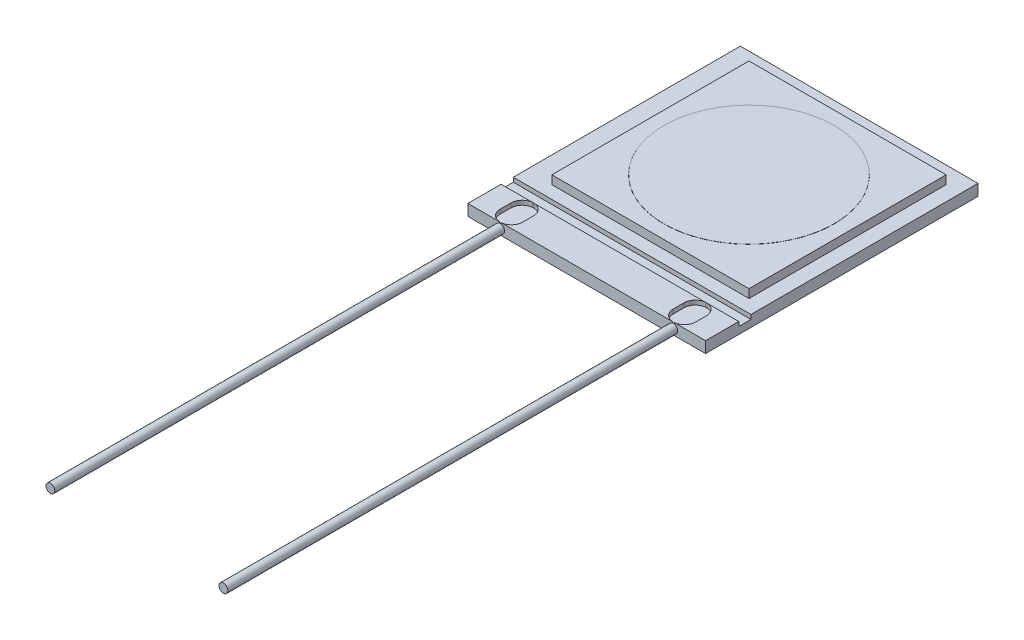
ISO-10303-21;
HEADER;
FILE_DESCRIPTION(('STEP AP214'),'2;1');
FILE_NAME('part.step','',(''),(''),'','','');
FILE_SCHEMA(('AUTOMOTIVE_DESIGN { 1 0 10303 214 1 1 1 1 }'));
ENDSEC;
DATA;
#1=APPLICATION_CONTEXT('core data for automotive mechanical design processes');
#2=APPLICATION_PROTOCOL_DEFINITION('international standard','automotive_design',2000,#1);
#3=PRODUCT_CONTEXT('',#1,'mechanical');
#4=PRODUCT('Part','Part','',(#3));
#5=PRODUCT_RELATED_PRODUCT_CATEGORY('part','',(#4));
#6=PRODUCT_DEFINITION_FORMATION('','',#4);
#7=PRODUCT_DEFINITION_CONTEXT('part definition',#1,'design');
#8=PRODUCT_DEFINITION('design','',#6,#7);
#9=PRODUCT_DEFINITION_SHAPE('','',#8);
#10=(LENGTH_UNIT() NAMED_UNIT(*) SI_UNIT(.MILLI.,.METRE.));
#11=(NAMED_UNIT(*) PLANE_ANGLE_UNIT() SI_UNIT($,.RADIAN.));
#12=(NAMED_UNIT(*) SI_UNIT($,.STERADIAN.) SOLID_ANGLE_UNIT());
#13=UNCERTAINTY_MEASURE_WITH_UNIT(LENGTH_MEASURE(1.E-05),#10,'distance_accuracy_value','');
#14=(GEOMETRIC_REPRESENTATION_CONTEXT(3) GLOBAL_UNCERTAINTY_ASSIGNED_CONTEXT((#13)) GLOBAL_UNIT_ASSIGNED_CONTEXT((#10,
#11,#12)) REPRESENTATION_CONTEXT('',''));
#15=CARTESIAN_POINT('',(0.,0.,0.));
#16=DIRECTION('',(0.,0.,1.));
#17=DIRECTION('',(1.,0.,0.));
#18=AXIS2_PLACEMENT_3D('',#15,#16,#17);
#19=CARTESIAN_POINT('',(3.49,0.3302,4.));
#20=DIRECTION('',(0.,0.,-1.));
#21=DIRECTION('',(-1.,0.,0.));
#22=AXIS2_PLACEMENT_3D('',#19,#20,#21);
#23=PLANE('',#22);
#24=CARTESIAN_POINT('',(2.54,0.165099999999987,4.));
#25=DIRECTION('',(0.,0.,1.));
#26=DIRECTION('',(-1.,0.,0.));
#27=AXIS2_PLACEMENT_3D('',#24,#25,#26);
#28=CIRCLE('',#27,0.129854710524441);
#29=CARTESIAN_POINT('',(2.51975239636127,0.293366442970372,4.));
#30=VERTEX_POINT('',#29);
#31=CARTESIAN_POINT('',(2.56024760363874,0.293366442970372,4.));
#32=VERTEX_POINT('',#31);
#33=EDGE_CURVE('E254',#30,#32,#28,.T.);
#34=ORIENTED_EDGE('',*,*,#33,.F.);
#35=DIRECTION('',(0.,1.,0.));
#36=VECTOR('',#35,1.);
#37=CARTESIAN_POINT('',(2.51975239636126,0.2032,4.));
#38=LINE('',#37,#36);
#39=CARTESIAN_POINT('',(2.51975239636126,0.3302,4.));
#40=VERTEX_POINT('',#39);
#41=EDGE_CURVE('E249',#30,#40,#38,.T.);
#42=ORIENTED_EDGE('',*,*,#41,.T.);
#43=DIRECTION('',(1.,0.,0.));
#44=VECTOR('',#43,1.);
#45=CARTESIAN_POINT('',(3.49,0.3302,4.));
#46=LINE('',#45,#44);
#47=CARTESIAN_POINT('',(-2.51975239636127,0.3302,4.));
#48=VERTEX_POINT('',#47);
#49=EDGE_CURVE('E267',#48,#40,#46,.T.);
#50=ORIENTED_EDGE('',*,*,#49,.F.);
#51=DIRECTION('',(0.,1.,0.));
#52=VECTOR('',#51,1.);
#53=CARTESIAN_POINT('',(-2.51975239636127,0.2032,4.));
#54=LINE('',#53,#52);
#55=CARTESIAN_POINT('',(-2.51975239636127,0.293366442970386,4.));
#56=VERTEX_POINT('',#55);
#57=EDGE_CURVE('E619',#56,#48,#54,.T.);
#58=ORIENTED_EDGE('',*,*,#57,.F.);
#59=CARTESIAN_POINT('',(-2.54,0.1651,4.));
#60=DIRECTION('',(0.,0.,1.));
#61=DIRECTION('',(1.,0.,0.));
#62=AXIS2_PLACEMENT_3D('',#59,#60,#61);
#63=CIRCLE('',#62,0.129854710524441);
#64=CARTESIAN_POINT('',(-2.56024760363873,0.293366442970386,4.));
#65=VERTEX_POINT('',#64);
#66=EDGE_CURVE('E12',#65,#56,#63,.T.);
#67=ORIENTED_EDGE('',*,*,#66,.F.);
#68=DIRECTION('',(0.,1.,0.));
#69=VECTOR('',#68,1.);
#70=CARTESIAN_POINT('',(-2.56024760363873,0.2032,4.));
#71=LINE('',#70,#69);
#72=CARTESIAN_POINT('',(-2.56024760363873,0.3302,4.));
#73=VERTEX_POINT('',#72);
#74=EDGE_CURVE('E248',#65,#73,#71,.T.);
#75=ORIENTED_EDGE('',*,*,#74,.T.);
#76=CARTESIAN_POINT('',(-3.49,0.3302,4.));
#77=VERTEX_POINT('',#76);
#78=EDGE_CURVE('E401',#77,#73,#46,.T.);
#79=ORIENTED_EDGE('',*,*,#78,.F.);
#80=DIRECTION('',(0.,-1.,0.));
#81=VECTOR('',#80,1.);
#82=CARTESIAN_POINT('',(-3.49,0.3302,4.));
#83=LINE('',#82,#81);
#84=CARTESIAN_POINT('',(-3.49,0.,4.));
#85=VERTEX_POINT('',#84);
#86=EDGE_CURVE('E419',#77,#85,#83,.T.);
#87=ORIENTED_EDGE('',*,*,#86,.T.);
#88=DIRECTION('',(1.,0.,0.));
#89=VECTOR('',#88,1.);
#90=CARTESIAN_POINT('',(3.49,0.,4.));
#91=LINE('',#90,#89);
#92=CARTESIAN_POINT('',(3.49,0.,4.));
#93=VERTEX_POINT('',#92);
#94=EDGE_CURVE('E416',#85,#93,#91,.T.);
#95=ORIENTED_EDGE('',*,*,#94,.T.);
#96=DIRECTION('',(0.,-1.,0.));
#97=VECTOR('',#96,1.);
#98=CARTESIAN_POINT('',(3.49,0.3302,4.));
#99=LINE('',#98,#97);
#100=CARTESIAN_POINT('',(3.49,0.3302,4.));
#101=VERTEX_POINT('',#100);
#102=EDGE_CURVE('E357',#101,#93,#99,.T.);
#103=ORIENTED_EDGE('',*,*,#102,.F.);
#104=CARTESIAN_POINT('',(2.56024760363874,0.3302,4.));
#105=VERTEX_POINT('',#104);
#106=EDGE_CURVE('E405',#105,#101,#46,.T.);
#107=ORIENTED_EDGE('',*,*,#106,.F.);
#108=DIRECTION('',(0.,1.,0.));
#109=VECTOR('',#108,1.);
#110=CARTESIAN_POINT('',(2.56024760363874,0.2032,4.));
#111=LINE('',#110,#109);
#112=EDGE_CURVE('E261',#32,#105,#111,.T.);
#113=ORIENTED_EDGE('',*,*,#112,.F.);
#114=EDGE_LOOP('',(#34,#42,#50,#58,#67,#75,#79,#87,#95,#103,#107,#113));
#115=FACE_BOUND('',#114,.T.);
#116=ADVANCED_FACE('F45',(#115),#23,.F.);
#117=CARTESIAN_POINT('',(3.055,0.5802,-3.5));
#118=DIRECTION('',(0.,-1.,0.));
#119=DIRECTION('',(0.,0.,-1.));
#120=AXIS2_PLACEMENT_3D('',#117,#118,#119);
#121=PLANE('',#120);
#122=DIRECTION('',(0.,0.,-1.));
#123=VECTOR('',#122,1.);
#124=CARTESIAN_POINT('',(3.055,0.5802,2.29));
#125=LINE('',#124,#123);
#126=CARTESIAN_POINT('',(3.055,0.5802,2.29));
#127=VERTEX_POINT('',#126);
#128=CARTESIAN_POINT('',(3.055,0.5802,-3.5));
#129=VERTEX_POINT('',#128);
#130=EDGE_CURVE('E332',#127,#129,#125,.T.);
#131=ORIENTED_EDGE('',*,*,#130,.T.);
#132=DIRECTION('',(-1.,0.,0.));
#133=VECTOR('',#132,1.);
#134=CARTESIAN_POINT('',(-2.735,0.5802,-3.5));
#135=LINE('',#134,#133);
#136=CARTESIAN_POINT('',(-2.735,0.5802,-3.5));
#137=VERTEX_POINT('',#136);
#138=EDGE_CURVE('E374',#129,#137,#135,.T.);
#139=ORIENTED_EDGE('',*,*,#138,.T.);
#140=DIRECTION('',(0.,0.,1.));
#141=VECTOR('',#140,1.);
#142=CARTESIAN_POINT('',(-2.735,0.5802,2.29));
#143=LINE('',#142,#141);
#144=CARTESIAN_POINT('',(-2.735,0.5802,2.29));
#145=VERTEX_POINT('',#144);
#146=EDGE_CURVE('E368',#137,#145,#143,.T.);
#147=ORIENTED_EDGE('',*,*,#146,.T.);
#148=DIRECTION('',(1.,0.,0.));
#149=VECTOR('',#148,1.);
#150=CARTESIAN_POINT('',(-2.735,0.5802,2.29));
#151=LINE('',#150,#149);
#152=EDGE_CURVE('E365',#145,#127,#151,.T.);
#153=ORIENTED_EDGE('',*,*,#152,.T.);
#154=EDGE_LOOP('',(#131,#139,#147,#153));
#155=FACE_BOUND('',#154,.T.);
#156=CARTESIAN_POINT('',(0.160000000000001,0.5802,-0.604999999999997));
#157=DIRECTION('',(0.,-1.,0.));
#158=DIRECTION('',(0.,0.,-1.));
#159=AXIS2_PLACEMENT_3D('',#156,#157,#158);
#160=CIRCLE('',#159,2.499995);
#161=CARTESIAN_POINT('',(0.160000000000001,0.5802,-3.104995));
#162=VERTEX_POINT('',#161);
#163=EDGE_CURVE('E49',#162,#162,#160,.F.);
#164=ORIENTED_EDGE('',*,*,#163,.F.);
#165=EDGE_LOOP('',(#164));
#166=FACE_BOUND('',#165,.T.);
#167=ADVANCED_FACE('F509',(#155,#166),#121,.F.);
#168=CARTESIAN_POINT('',(-3.49,0.3302,-4.));
#169=DIRECTION('',(0.,1.,0.));
#170=DIRECTION('',(0.,0.,1.));
#171=AXIS2_PLACEMENT_3D('',#168,#169,#170);
#172=PLANE('',#171);
#173=DIRECTION('',(1.,0.,0.));
#174=VECTOR('',#173,1.);
#175=CARTESIAN_POINT('',(0.,0.3302,3.02464));
#176=LINE('',#175,#174);
#177=CARTESIAN_POINT('',(2.56511819770642,0.3302,3.02464));
#178=VERTEX_POINT('',#177);
#179=CARTESIAN_POINT('',(3.49,0.3302,3.02464));
#180=VERTEX_POINT('',#179);
#181=EDGE_CURVE('E295',#178,#180,#176,.T.);
#182=ORIENTED_EDGE('',*,*,#181,.F.);
#183=CARTESIAN_POINT('',(2.54,0.3302,3.35388324768168));
#184=DIRECTION('',(0.,1.,0.));
#185=DIRECTION('',(0.,0.,1.));
#186=AXIS2_PLACEMENT_3D('',#183,#184,#185);
#187=CIRCLE('',#186,0.3302);
#188=CARTESIAN_POINT('',(2.8702,0.3302,3.35388324768168));
#189=VERTEX_POINT('',#188);
#190=EDGE_CURVE('E467',#178,#189,#187,.F.);
#191=ORIENTED_EDGE('',*,*,#190,.T.);
#192=DIRECTION('',(0.,0.,-1.));
#193=VECTOR('',#192,1.);
#194=CARTESIAN_POINT('',(2.8702,0.3302,0.));
#195=LINE('',#194,#193);
#196=CARTESIAN_POINT('',(2.8702,0.3302,3.67042136818828));
#197=VERTEX_POINT('',#196);
#198=EDGE_CURVE('E477',#197,#189,#195,.T.);
#199=ORIENTED_EDGE('',*,*,#198,.F.);
#200=CARTESIAN_POINT('',(2.54,0.3302,3.67042136818828));
#201=DIRECTION('',(0.,1.,0.));
#202=DIRECTION('',(0.,0.,1.));
#203=AXIS2_PLACEMENT_3D('',#200,#201,#202);
#204=CIRCLE('',#203,0.3302);
#205=EDGE_CURVE('E269',#197,#105,#204,.F.);
#206=ORIENTED_EDGE('',*,*,#205,.T.);
#207=ORIENTED_EDGE('',*,*,#106,.T.);
#208=DIRECTION('',(0.,0.,-1.));
#209=VECTOR('',#208,1.);
#210=CARTESIAN_POINT('',(3.49,0.3302,4.));
#211=LINE('',#210,#209);
#212=EDGE_CURVE('E406',#101,#180,#211,.T.);
#213=ORIENTED_EDGE('',*,*,#212,.T.);
#214=EDGE_LOOP('',(#182,#191,#199,#206,#207,#213));
#215=FACE_BOUND('',#214,.T.);
#216=ADVANCED_FACE('F514',(#215),#172,.T.);
#217=DIRECTION('',(0.,0.,-1.));
#218=VECTOR('',#217,1.);
#219=CARTESIAN_POINT('',(2.2098,0.3302,0.));
#220=LINE('',#219,#218);
#221=CARTESIAN_POINT('',(2.2098,0.3302,3.67042136818828));
#222=VERTEX_POINT('',#221);
#223=CARTESIAN_POINT('',(2.2098,0.3302,3.35388324768168));
#224=VERTEX_POINT('',#223);
#225=EDGE_CURVE('E409',#222,#224,#220,.T.);
#226=ORIENTED_EDGE('',*,*,#225,.T.);
#227=CARTESIAN_POINT('',(2.51488180229358,0.3302,3.02464));
#228=VERTEX_POINT('',#227);
#229=EDGE_CURVE('E464',#224,#228,#187,.F.);
#230=ORIENTED_EDGE('',*,*,#229,.T.);
#231=CARTESIAN_POINT('',(-2.51488180229356,0.3302,3.02464));
#232=VERTEX_POINT('',#231);
#233=EDGE_CURVE('E306',#232,#228,#176,.T.);
#234=ORIENTED_EDGE('',*,*,#233,.F.);
#235=CARTESIAN_POINT('',(-2.54,0.3302,3.35388324768168));
#236=DIRECTION('',(0.,1.,0.));
#237=DIRECTION('',(0.,0.,1.));
#238=AXIS2_PLACEMENT_3D('',#235,#236,#237);
#239=CIRCLE('',#238,0.3302);
#240=CARTESIAN_POINT('',(-2.2098,0.3302,3.35388324768168));
#241=VERTEX_POINT('',#240);
#242=EDGE_CURVE('E304',#241,#232,#239,.T.);
#243=ORIENTED_EDGE('',*,*,#242,.F.);
#244=DIRECTION('',(0.,0.,-1.));
#245=VECTOR('',#244,1.);
#246=CARTESIAN_POINT('',(-2.2098,0.3302,0.));
#247=LINE('',#246,#245);
#248=CARTESIAN_POINT('',(-2.2098,0.3302,3.67042136818828));
#249=VERTEX_POINT('',#248);
#250=EDGE_CURVE('E433',#249,#241,#247,.T.);
#251=ORIENTED_EDGE('',*,*,#250,.F.);
#252=CARTESIAN_POINT('',(-2.54,0.3302,3.67042136818828));
#253=DIRECTION('',(0.,1.,0.));
#254=DIRECTION('',(0.,0.,1.));
#255=AXIS2_PLACEMENT_3D('',#252,#253,#254);
#256=CIRCLE('',#255,0.3302);
#257=EDGE_CURVE('E620',#48,#249,#256,.T.);
#258=ORIENTED_EDGE('',*,*,#257,.F.);
#259=ORIENTED_EDGE('',*,*,#49,.T.);
#260=EDGE_CURVE('E265',#40,#222,#204,.F.);
#261=ORIENTED_EDGE('',*,*,#260,.T.);
#262=EDGE_LOOP('',(#226,#230,#234,#243,#251,#258,#259,#261));
#263=FACE_BOUND('',#262,.T.);
#264=ADVANCED_FACE('F543',(#263),#172,.T.);
#265=CARTESIAN_POINT('',(-2.8702,0.3302,3.67042136818828));
#266=VERTEX_POINT('',#265);
#267=EDGE_CURVE('E614',#266,#73,#256,.T.);
#268=ORIENTED_EDGE('',*,*,#267,.F.);
#269=DIRECTION('',(0.,0.,-1.));
#270=VECTOR('',#269,1.);
#271=CARTESIAN_POINT('',(-2.8702,0.3302,0.));
#272=LINE('',#271,#270);
#273=CARTESIAN_POINT('',(-2.8702,0.3302,3.35388324768168));
#274=VERTEX_POINT('',#273);
#275=EDGE_CURVE('E418',#266,#274,#272,.T.);
#276=ORIENTED_EDGE('',*,*,#275,.T.);
#277=CARTESIAN_POINT('',(-2.56511819770644,0.3302,3.02464));
#278=VERTEX_POINT('',#277);
#279=EDGE_CURVE('E305',#278,#274,#239,.T.);
#280=ORIENTED_EDGE('',*,*,#279,.F.);
#281=CARTESIAN_POINT('',(-3.49,0.3302,3.02464));
#282=VERTEX_POINT('',#281);
#283=EDGE_CURVE('E309',#282,#278,#176,.T.);
#284=ORIENTED_EDGE('',*,*,#283,.F.);
#285=DIRECTION('',(0.,0.,1.));
#286=VECTOR('',#285,1.);
#287=CARTESIAN_POINT('',(-3.49,0.3302,4.));
#288=LINE('',#287,#286);
#289=EDGE_CURVE('E402',#282,#77,#288,.T.);
#290=ORIENTED_EDGE('',*,*,#289,.T.);
#291=ORIENTED_EDGE('',*,*,#78,.T.);
#292=EDGE_LOOP('',(#268,#276,#280,#284,#290,#291));
#293=FACE_BOUND('',#292,.T.);
#294=ADVANCED_FACE('F608',(#293),#172,.T.);
#295=DIRECTION('',(-1.,0.,0.));
#296=VECTOR('',#295,1.);
#297=CARTESIAN_POINT('',(-2.735,0.3302,-3.5));
#298=LINE('',#297,#296);
#299=CARTESIAN_POINT('',(3.055,0.3302,-3.5));
#300=VERTEX_POINT('',#299);
#301=CARTESIAN_POINT('',(-2.735,0.3302,-3.5));
#302=VERTEX_POINT('',#301);
#303=EDGE_CURVE('E382',#300,#302,#298,.T.);
#304=ORIENTED_EDGE('',*,*,#303,.F.);
#305=DIRECTION('',(0.,0.,-1.));
#306=VECTOR('',#305,1.);
#307=CARTESIAN_POINT('',(3.055,0.3302,2.29));
#308=LINE('',#307,#306);
#309=CARTESIAN_POINT('',(3.055,0.3302,2.29));
#310=VERTEX_POINT('',#309);
#311=EDGE_CURVE('E377',#310,#300,#308,.T.);
#312=ORIENTED_EDGE('',*,*,#311,.F.);
#313=DIRECTION('',(1.,0.,0.));
#314=VECTOR('',#313,1.);
#315=CARTESIAN_POINT('',(-2.735,0.3302,2.29));
#316=LINE('',#315,#314);
#317=CARTESIAN_POINT('',(-2.735,0.3302,2.29));
#318=VERTEX_POINT('',#317);
#319=EDGE_CURVE('E389',#318,#310,#316,.T.);
#320=ORIENTED_EDGE('',*,*,#319,.F.);
#321=DIRECTION('',(0.,0.,1.));
#322=VECTOR('',#321,1.);
#323=CARTESIAN_POINT('',(-2.735,0.3302,2.29));
#324=LINE('',#323,#322);
#325=EDGE_CURVE('E385',#302,#318,#324,.T.);
#326=ORIENTED_EDGE('',*,*,#325,.F.);
#327=EDGE_LOOP('',(#304,#312,#320,#326));
#328=FACE_BOUND('',#327,.T.);
#329=CARTESIAN_POINT('',(-3.49,0.3302,-4.));
#330=VERTEX_POINT('',#329);
#331=CARTESIAN_POINT('',(-3.49,0.3302,2.6665));
#332=VERTEX_POINT('',#331);
#333=EDGE_CURVE('E398',#330,#332,#288,.T.);
#334=ORIENTED_EDGE('',*,*,#333,.T.);
#335=DIRECTION('',(1.,0.,0.));
#336=VECTOR('',#335,1.);
#337=CARTESIAN_POINT('',(0.,0.3302,2.6665));
#338=LINE('',#337,#336);
#339=CARTESIAN_POINT('',(3.49,0.3302,2.6665));
#340=VERTEX_POINT('',#339);
#341=EDGE_CURVE('E321',#332,#340,#338,.T.);
#342=ORIENTED_EDGE('',*,*,#341,.T.);
#343=CARTESIAN_POINT('',(3.49,0.3302,-4.));
#344=VERTEX_POINT('',#343);
#345=EDGE_CURVE('E410',#340,#344,#211,.T.);
#346=ORIENTED_EDGE('',*,*,#345,.T.);
#347=DIRECTION('',(-1.,0.,0.));
#348=VECTOR('',#347,1.);
#349=CARTESIAN_POINT('',(3.49,0.3302,-4.));
#350=LINE('',#349,#348);
#351=EDGE_CURVE('E358',#344,#330,#350,.T.);
#352=ORIENTED_EDGE('',*,*,#351,.T.);
#353=EDGE_LOOP('',(#334,#342,#346,#352));
#354=FACE_BOUND('',#353,.T.);
#355=ADVANCED_FACE('F592',(#328,#354),#172,.T.);
#356=CARTESIAN_POINT('',(3.49,0.3302,4.));
#357=DIRECTION('',(-1.,0.,0.));
#358=DIRECTION('',(0.,0.,1.));
#359=AXIS2_PLACEMENT_3D('',#356,#357,#358);
#360=PLANE('',#359);
#361=DIRECTION('',(0.,1.,0.));
#362=VECTOR('',#361,1.);
#363=CARTESIAN_POINT('',(3.49,0.2032,2.6665));
#364=LINE('',#363,#362);
#365=CARTESIAN_POINT('',(3.49,0.2032,2.6665));
#366=VERTEX_POINT('',#365);
#367=EDGE_CURVE('E327',#366,#340,#364,.T.);
#368=ORIENTED_EDGE('',*,*,#367,.F.);
#369=DIRECTION('',(0.,0.,-1.));
#370=VECTOR('',#369,1.);
#371=CARTESIAN_POINT('',(3.49,0.2032,0.));
#372=LINE('',#371,#370);
#373=CARTESIAN_POINT('',(3.49,0.2032,3.02464));
#374=VERTEX_POINT('',#373);
#375=EDGE_CURVE('E331',#374,#366,#372,.T.);
#376=ORIENTED_EDGE('',*,*,#375,.F.);
#377=DIRECTION('',(0.,1.,0.));
#378=VECTOR('',#377,1.);
#379=CARTESIAN_POINT('',(3.49,0.2032,3.02464));
#380=LINE('',#379,#378);
#381=EDGE_CURVE('E355',#374,#180,#380,.T.);
#382=ORIENTED_EDGE('',*,*,#381,.T.);
#383=ORIENTED_EDGE('',*,*,#212,.F.);
#384=ORIENTED_EDGE('',*,*,#102,.T.);
#385=DIRECTION('',(0.,0.,-1.));
#386=VECTOR('',#385,1.);
#387=CARTESIAN_POINT('',(3.49,0.,4.));
#388=LINE('',#387,#386);
#389=CARTESIAN_POINT('',(3.49,0.,-4.));
#390=VERTEX_POINT('',#389);
#391=EDGE_CURVE('E353',#93,#390,#388,.T.);
#392=ORIENTED_EDGE('',*,*,#391,.T.);
#393=DIRECTION('',(0.,-1.,0.));
#394=VECTOR('',#393,1.);
#395=CARTESIAN_POINT('',(3.49,0.3302,-4.));
#396=LINE('',#395,#394);
#397=EDGE_CURVE('E381',#344,#390,#396,.T.);
#398=ORIENTED_EDGE('',*,*,#397,.F.);
#399=ORIENTED_EDGE('',*,*,#345,.F.);
#400=EDGE_LOOP('',(#368,#376,#382,#383,#384,#392,#398,#399));
#401=FACE_BOUND('',#400,.T.);
#402=ADVANCED_FACE('F518',(#401),#360,.F.);
#403=CARTESIAN_POINT('',(-3.49,0.3302,4.));
#404=DIRECTION('',(1.,0.,0.));
#405=DIRECTION('',(0.,0.,-1.));
#406=AXIS2_PLACEMENT_3D('',#403,#404,#405);
#407=PLANE('',#406);
#408=ORIENTED_EDGE('',*,*,#289,.F.);
#409=DIRECTION('',(0.,1.,0.));
#410=VECTOR('',#409,1.);
#411=CARTESIAN_POINT('',(-3.49,0.2032,3.02464));
#412=LINE('',#411,#410);
#413=CARTESIAN_POINT('',(-3.49,0.2032,3.02464));
#414=VERTEX_POINT('',#413);
#415=EDGE_CURVE('E312',#414,#282,#412,.T.);
#416=ORIENTED_EDGE('',*,*,#415,.F.);
#417=DIRECTION('',(0.,0.,1.));
#418=VECTOR('',#417,1.);
#419=CARTESIAN_POINT('',(-3.49,0.2032,0.));
#420=LINE('',#419,#418);
#421=CARTESIAN_POINT('',(-3.49,0.2032,2.6665));
#422=VERTEX_POINT('',#421);
#423=EDGE_CURVE('E319',#422,#414,#420,.T.);
#424=ORIENTED_EDGE('',*,*,#423,.F.);
#425=DIRECTION('',(0.,1.,0.));
#426=VECTOR('',#425,1.);
#427=CARTESIAN_POINT('',(-3.49,0.2032,2.6665));
#428=LINE('',#427,#426);
#429=EDGE_CURVE('E350',#422,#332,#428,.T.);
#430=ORIENTED_EDGE('',*,*,#429,.T.);
#431=ORIENTED_EDGE('',*,*,#333,.F.);
#432=DIRECTION('',(0.,-1.,0.));
#433=VECTOR('',#432,1.);
#434=CARTESIAN_POINT('',(-3.49,0.3302,-4.));
#435=LINE('',#434,#433);
#436=CARTESIAN_POINT('',(-3.49,0.,-4.));
#437=VERTEX_POINT('',#436);
#438=EDGE_CURVE('E352',#330,#437,#435,.T.);
#439=ORIENTED_EDGE('',*,*,#438,.T.);
#440=DIRECTION('',(0.,0.,1.));
#441=VECTOR('',#440,1.);
#442=CARTESIAN_POINT('',(-3.49,0.,4.));
#443=LINE('',#442,#441);
#444=EDGE_CURVE('E412',#437,#85,#443,.T.);
#445=ORIENTED_EDGE('',*,*,#444,.T.);
#446=ORIENTED_EDGE('',*,*,#86,.F.);
#447=EDGE_LOOP('',(#408,#416,#424,#430,#431,#439,#445,#446));
#448=FACE_BOUND('',#447,.T.);
#449=ADVANCED_FACE('F520',(#448),#407,.F.);
#450=CARTESIAN_POINT('',(3.49,0.3302,-4.));
#451=DIRECTION('',(0.,0.,1.));
#452=DIRECTION('',(1.,0.,0.));
#453=AXIS2_PLACEMENT_3D('',#450,#451,#452);
#454=PLANE('',#453);
#455=DIRECTION('',(-1.,0.,0.));
#456=VECTOR('',#455,1.);
#457=CARTESIAN_POINT('',(3.49,0.,-4.));
#458=LINE('',#457,#456);
#459=EDGE_CURVE('E415',#390,#437,#458,.T.);
#460=ORIENTED_EDGE('',*,*,#459,.T.);
#461=ORIENTED_EDGE('',*,*,#438,.F.);
#462=ORIENTED_EDGE('',*,*,#351,.F.);
#463=ORIENTED_EDGE('',*,*,#397,.T.);
#464=EDGE_LOOP('',(#460,#461,#462,#463));
#465=FACE_BOUND('',#464,.T.);
#466=ADVANCED_FACE('F523',(#465),#454,.F.);
#467=CARTESIAN_POINT('',(-3.49,0.,-4.));
#468=DIRECTION('',(0.,1.,0.));
#469=DIRECTION('',(0.,0.,1.));
#470=AXIS2_PLACEMENT_3D('',#467,#468,#469);
#471=PLANE('',#470);
#472=ORIENTED_EDGE('',*,*,#444,.F.);
#473=ORIENTED_EDGE('',*,*,#459,.F.);
#474=ORIENTED_EDGE('',*,*,#391,.F.);
#475=ORIENTED_EDGE('',*,*,#94,.F.);
#476=EDGE_LOOP('',(#472,#473,#474,#475));
#477=FACE_BOUND('',#476,.T.);
#478=ADVANCED_FACE('F582',(#477),#471,.F.);
#479=CARTESIAN_POINT('',(3.055,0.5802,2.29));
#480=DIRECTION('',(-1.,0.,0.));
#481=DIRECTION('',(0.,0.,1.));
#482=AXIS2_PLACEMENT_3D('',#479,#480,#481);
#483=PLANE('',#482);
#484=ORIENTED_EDGE('',*,*,#311,.T.);
#485=DIRECTION('',(0.,-1.,0.));
#486=VECTOR('',#485,1.);
#487=CARTESIAN_POINT('',(3.055,0.5802,-3.5));
#488=LINE('',#487,#486);
#489=EDGE_CURVE('E384',#129,#300,#488,.T.);
#490=ORIENTED_EDGE('',*,*,#489,.F.);
#491=ORIENTED_EDGE('',*,*,#130,.F.);
#492=DIRECTION('',(0.,-1.,0.));
#493=VECTOR('',#492,1.);
#494=CARTESIAN_POINT('',(3.055,0.5802,2.29));
#495=LINE('',#494,#493);
#496=EDGE_CURVE('E380',#127,#310,#495,.T.);
#497=ORIENTED_EDGE('',*,*,#496,.T.);
#498=EDGE_LOOP('',(#484,#490,#491,#497));
#499=FACE_BOUND('',#498,.T.);
#500=ADVANCED_FACE('F848',(#499),#483,.F.);
#501=CARTESIAN_POINT('',(-2.735,0.5802,-3.5));
#502=DIRECTION('',(0.,0.,1.));
#503=DIRECTION('',(1.,0.,0.));
#504=AXIS2_PLACEMENT_3D('',#501,#502,#503);
#505=PLANE('',#504);
#506=ORIENTED_EDGE('',*,*,#303,.T.);
#507=DIRECTION('',(0.,-1.,0.));
#508=VECTOR('',#507,1.);
#509=CARTESIAN_POINT('',(-2.735,0.5802,-3.5));
#510=LINE('',#509,#508);
#511=EDGE_CURVE('E388',#137,#302,#510,.T.);
#512=ORIENTED_EDGE('',*,*,#511,.F.);
#513=ORIENTED_EDGE('',*,*,#138,.F.);
#514=ORIENTED_EDGE('',*,*,#489,.T.);
#515=EDGE_LOOP('',(#506,#512,#513,#514));
#516=FACE_BOUND('',#515,.T.);
#517=ADVANCED_FACE('F838',(#516),#505,.F.);
#518=CARTESIAN_POINT('',(-2.735,0.5802,2.29));
#519=DIRECTION('',(1.,0.,0.));
#520=DIRECTION('',(0.,0.,-1.));
#521=AXIS2_PLACEMENT_3D('',#518,#519,#520);
#522=PLANE('',#521);
#523=ORIENTED_EDGE('',*,*,#325,.T.);
#524=DIRECTION('',(0.,-1.,0.));
#525=VECTOR('',#524,1.);
#526=CARTESIAN_POINT('',(-2.735,0.5802,2.29));
#527=LINE('',#526,#525);
#528=EDGE_CURVE('E391',#145,#318,#527,.T.);
#529=ORIENTED_EDGE('',*,*,#528,.F.);
#530=ORIENTED_EDGE('',*,*,#146,.F.);
#531=ORIENTED_EDGE('',*,*,#511,.T.);
#532=EDGE_LOOP('',(#523,#529,#530,#531));
#533=FACE_BOUND('',#532,.T.);
#534=ADVANCED_FACE('F557',(#533),#522,.F.);
#535=CARTESIAN_POINT('',(-2.735,0.5802,2.29));
#536=DIRECTION('',(0.,0.,-1.));
#537=DIRECTION('',(-1.,0.,0.));
#538=AXIS2_PLACEMENT_3D('',#535,#536,#537);
#539=PLANE('',#538);
#540=ORIENTED_EDGE('',*,*,#319,.T.);
#541=ORIENTED_EDGE('',*,*,#496,.F.);
#542=ORIENTED_EDGE('',*,*,#152,.F.);
#543=ORIENTED_EDGE('',*,*,#528,.T.);
#544=EDGE_LOOP('',(#540,#541,#542,#543));
#545=FACE_BOUND('',#544,.T.);
#546=ADVANCED_FACE('F549',(#545),#539,.F.);
#547=CARTESIAN_POINT('',(0.,0.2032,3.02464));
#548=DIRECTION('',(0.,0.,1.));
#549=DIRECTION('',(1.,0.,0.));
#550=AXIS2_PLACEMENT_3D('',#547,#548,#549);
#551=PLANE('',#550);
#552=ORIENTED_EDGE('',*,*,#233,.T.);
#553=DIRECTION('',(0.,1.,0.));
#554=VECTOR('',#553,1.);
#555=CARTESIAN_POINT('',(2.51488180229358,0.2032,3.02464));
#556=LINE('',#555,#554);
#557=CARTESIAN_POINT('',(2.51488180229358,0.2032,3.02464));
#558=VERTEX_POINT('',#557);
#559=EDGE_CURVE('E284',#558,#228,#556,.T.);
#560=ORIENTED_EDGE('',*,*,#559,.F.);
#561=DIRECTION('',(1.,0.,0.));
#562=VECTOR('',#561,1.);
#563=CARTESIAN_POINT('',(0.,0.2032,3.02464));
#564=LINE('',#563,#562);
#565=CARTESIAN_POINT('',(-2.51488180229356,0.2032,3.02464));
#566=VERTEX_POINT('',#565);
#567=EDGE_CURVE('E294',#566,#558,#564,.T.);
#568=ORIENTED_EDGE('',*,*,#567,.F.);
#569=DIRECTION('',(0.,1.,0.));
#570=VECTOR('',#569,1.);
#571=CARTESIAN_POINT('',(-2.51488180229356,0.2032,3.02464));
#572=LINE('',#571,#570);
#573=EDGE_CURVE('E313',#566,#232,#572,.T.);
#574=ORIENTED_EDGE('',*,*,#573,.T.);
#575=EDGE_LOOP('',(#552,#560,#568,#574));
#576=FACE_BOUND('',#575,.T.);
#577=ADVANCED_FACE('F546',(#576),#551,.F.);
#578=ORIENTED_EDGE('',*,*,#283,.T.);
#579=DIRECTION('',(0.,1.,0.));
#580=VECTOR('',#579,1.);
#581=CARTESIAN_POINT('',(-2.56511819770644,0.2032,3.02464));
#582=LINE('',#581,#580);
#583=CARTESIAN_POINT('',(-2.56511819770644,0.2032,3.02464));
#584=VERTEX_POINT('',#583);
#585=EDGE_CURVE('E301',#584,#278,#582,.T.);
#586=ORIENTED_EDGE('',*,*,#585,.F.);
#587=EDGE_CURVE('E328',#414,#584,#564,.T.);
#588=ORIENTED_EDGE('',*,*,#587,.F.);
#589=ORIENTED_EDGE('',*,*,#415,.T.);
#590=EDGE_LOOP('',(#578,#586,#588,#589));
#591=FACE_BOUND('',#590,.T.);
#592=ADVANCED_FACE('F548',(#591),#551,.F.);
#593=CARTESIAN_POINT('',(0.,0.2032,2.6665));
#594=DIRECTION('',(0.,0.,1.));
#595=DIRECTION('',(1.,0.,0.));
#596=AXIS2_PLACEMENT_3D('',#593,#594,#595);
#597=PLANE('',#596);
#598=ORIENTED_EDGE('',*,*,#341,.F.);
#599=ORIENTED_EDGE('',*,*,#429,.F.);
#600=DIRECTION('',(1.,0.,0.));
#601=VECTOR('',#600,1.);
#602=CARTESIAN_POINT('',(0.,0.2032,2.6665));
#603=LINE('',#602,#601);
#604=EDGE_CURVE('E342',#422,#366,#603,.T.);
#605=ORIENTED_EDGE('',*,*,#604,.T.);
#606=ORIENTED_EDGE('',*,*,#367,.T.);
#607=EDGE_LOOP('',(#598,#599,#605,#606));
#608=FACE_BOUND('',#607,.T.);
#609=ADVANCED_FACE('F556',(#608),#597,.T.);
#610=ORIENTED_EDGE('',*,*,#181,.T.);
#611=ORIENTED_EDGE('',*,*,#381,.F.);
#612=CARTESIAN_POINT('',(2.56511819770642,0.2032,3.02464));
#613=VERTEX_POINT('',#612);
#614=EDGE_CURVE('E329',#613,#374,#564,.T.);
#615=ORIENTED_EDGE('',*,*,#614,.F.);
#616=DIRECTION('',(0.,1.,0.));
#617=VECTOR('',#616,1.);
#618=CARTESIAN_POINT('',(2.56511819770642,0.2032,3.02464));
#619=LINE('',#618,#617);
#620=EDGE_CURVE('E291',#613,#178,#619,.T.);
#621=ORIENTED_EDGE('',*,*,#620,.T.);
#622=EDGE_LOOP('',(#610,#611,#615,#621));
#623=FACE_BOUND('',#622,.T.);
#624=ADVANCED_FACE('F551',(#623),#551,.F.);
#625=CARTESIAN_POINT('',(0.,0.2032,0.));
#626=DIRECTION('',(0.,1.,0.));
#627=DIRECTION('',(0.,0.,1.));
#628=AXIS2_PLACEMENT_3D('',#625,#626,#627);
#629=PLANE('',#628);
#630=ORIENTED_EDGE('',*,*,#567,.T.);
#631=CARTESIAN_POINT('',(2.54,0.2032,3.35388324768168));
#632=DIRECTION('',(0.,1.,0.));
#633=DIRECTION('',(0.,0.,1.));
#634=AXIS2_PLACEMENT_3D('',#631,#632,#633);
#635=CIRCLE('',#634,0.3302);
#636=CARTESIAN_POINT('',(2.2098,0.2032,3.35388324768168));
#637=VERTEX_POINT('',#636);
#638=EDGE_CURVE('E287',#637,#558,#635,.F.);
#639=ORIENTED_EDGE('',*,*,#638,.F.);
#640=DIRECTION('',(0.,0.,-1.));
#641=VECTOR('',#640,1.);
#642=CARTESIAN_POINT('',(2.2098,0.2032,0.));
#643=LINE('',#642,#641);
#644=CARTESIAN_POINT('',(2.2098,0.2032,3.67042136818828));
#645=VERTEX_POINT('',#644);
#646=EDGE_CURVE('E280',#645,#637,#643,.T.);
#647=ORIENTED_EDGE('',*,*,#646,.F.);
#648=CARTESIAN_POINT('',(2.54,0.2032,3.67042136818828));
#649=DIRECTION('',(0.,1.,0.));
#650=DIRECTION('',(0.,0.,1.));
#651=AXIS2_PLACEMENT_3D('',#648,#649,#650);
#652=CIRCLE('',#651,0.3302);
#653=CARTESIAN_POINT('',(2.51975239636127,0.2032,4.));
#654=VERTEX_POINT('',#653);
#655=EDGE_CURVE('E277',#654,#645,#652,.F.);
#656=ORIENTED_EDGE('',*,*,#655,.F.);
#657=DIRECTION('',(1.,0.,0.));
#658=VECTOR('',#657,1.);
#659=CARTESIAN_POINT('',(0.,0.2032,4.));
#660=LINE('',#659,#658);
#661=CARTESIAN_POINT('',(2.56024760363873,0.2032,4.));
#662=VERTEX_POINT('',#661);
#663=EDGE_CURVE('E244',#654,#662,#660,.T.);
#664=ORIENTED_EDGE('',*,*,#663,.T.);
#665=CARTESIAN_POINT('',(2.8702,0.2032,3.67042136818828));
#666=VERTEX_POINT('',#665);
#667=EDGE_CURVE('E276',#666,#662,#652,.F.);
#668=ORIENTED_EDGE('',*,*,#667,.F.);
#669=DIRECTION('',(0.,0.,-1.));
#670=VECTOR('',#669,1.);
#671=CARTESIAN_POINT('',(2.8702,0.2032,0.));
#672=LINE('',#671,#670);
#673=CARTESIAN_POINT('',(2.8702,0.2032,3.35388324768168));
#674=VERTEX_POINT('',#673);
#675=EDGE_CURVE('E472',#666,#674,#672,.T.);
#676=ORIENTED_EDGE('',*,*,#675,.T.);
#677=EDGE_CURVE('E288',#613,#674,#635,.F.);
#678=ORIENTED_EDGE('',*,*,#677,.F.);
#679=ORIENTED_EDGE('',*,*,#614,.T.);
#680=ORIENTED_EDGE('',*,*,#375,.T.);
#681=ORIENTED_EDGE('',*,*,#604,.F.);
#682=ORIENTED_EDGE('',*,*,#423,.T.);
#683=ORIENTED_EDGE('',*,*,#587,.T.);
#684=CARTESIAN_POINT('',(-2.54,0.2032,3.35388324768168));
#685=DIRECTION('',(0.,1.,0.));
#686=DIRECTION('',(0.,0.,1.));
#687=AXIS2_PLACEMENT_3D('',#684,#685,#686);
#688=CIRCLE('',#687,0.3302);
#689=CARTESIAN_POINT('',(-2.8702,0.2032,3.35388324768168));
#690=VERTEX_POINT('',#689);
#691=EDGE_CURVE('E434',#584,#690,#688,.T.);
#692=ORIENTED_EDGE('',*,*,#691,.T.);
#693=DIRECTION('',(0.,0.,-1.));
#694=VECTOR('',#693,1.);
#695=CARTESIAN_POINT('',(-2.8702,0.2032,0.));
#696=LINE('',#695,#694);
#697=CARTESIAN_POINT('',(-2.8702,0.2032,3.67042136818828));
#698=VERTEX_POINT('',#697);
#699=EDGE_CURVE('E438',#698,#690,#696,.T.);
#700=ORIENTED_EDGE('',*,*,#699,.F.);
#701=CARTESIAN_POINT('',(-2.54,0.2032,3.67042136818828));
#702=DIRECTION('',(0.,1.,0.));
#703=DIRECTION('',(0.,0.,1.));
#704=AXIS2_PLACEMENT_3D('',#701,#702,#703);
#705=CIRCLE('',#704,0.3302);
#706=CARTESIAN_POINT('',(-2.56024760363873,0.2032,4.));
#707=VERTEX_POINT('',#706);
#708=EDGE_CURVE('E443',#698,#707,#705,.T.);
#709=ORIENTED_EDGE('',*,*,#708,.T.);
#710=DIRECTION('',(1.,0.,0.));
#711=VECTOR('',#710,1.);
#712=CARTESIAN_POINT('',(0.,0.2032,4.));
#713=LINE('',#712,#711);
#714=CARTESIAN_POINT('',(-2.51975239636127,0.2032,4.));
#715=VERTEX_POINT('',#714);
#716=EDGE_CURVE('E446',#707,#715,#713,.T.);
#717=ORIENTED_EDGE('',*,*,#716,.T.);
#718=CARTESIAN_POINT('',(-2.2098,0.2032,3.67042136818828));
#719=VERTEX_POINT('',#718);
#720=EDGE_CURVE('E447',#715,#719,#705,.T.);
#721=ORIENTED_EDGE('',*,*,#720,.T.);
#722=DIRECTION('',(0.,0.,-1.));
#723=VECTOR('',#722,1.);
#724=CARTESIAN_POINT('',(-2.2098,0.2032,0.));
#725=LINE('',#724,#723);
#726=CARTESIAN_POINT('',(-2.2098,0.2032,3.35388324768168));
#727=VERTEX_POINT('',#726);
#728=EDGE_CURVE('E337',#719,#727,#725,.T.);
#729=ORIENTED_EDGE('',*,*,#728,.T.);
#730=EDGE_CURVE('E431',#727,#566,#688,.T.);
#731=ORIENTED_EDGE('',*,*,#730,.T.);
#732=EDGE_LOOP('',(#630,#639,#647,#656,#664,#668,#676,#678,#679,#680,#681,#682,#683,#692,#700,
#709,#717,#721,#729,#731));
#733=FACE_BOUND('',#732,.T.);
#734=ADVANCED_FACE('F496',(#733),#629,.T.);
#735=CARTESIAN_POINT('',(-2.2098,0.2032,0.));
#736=DIRECTION('',(1.,0.,0.));
#737=DIRECTION('',(0.,0.,-1.));
#738=AXIS2_PLACEMENT_3D('',#735,#736,#737);
#739=PLANE('',#738);
#740=ORIENTED_EDGE('',*,*,#250,.T.);
#741=DIRECTION('',(0.,1.,0.));
#742=VECTOR('',#741,1.);
#743=CARTESIAN_POINT('',(-2.2098,0.2032,3.35388324768168));
#744=LINE('',#743,#742);
#745=EDGE_CURVE('E457',#727,#241,#744,.T.);
#746=ORIENTED_EDGE('',*,*,#745,.F.);
#747=ORIENTED_EDGE('',*,*,#728,.F.);
#748=DIRECTION('',(0.,1.,0.));
#749=VECTOR('',#748,1.);
#750=CARTESIAN_POINT('',(-2.2098,0.2032,3.67042136818828));
#751=LINE('',#750,#749);
#752=EDGE_CURVE('E451',#719,#249,#751,.T.);
#753=ORIENTED_EDGE('',*,*,#752,.T.);
#754=EDGE_LOOP('',(#740,#746,#747,#753));
#755=FACE_BOUND('',#754,.T.);
#756=ADVANCED_FACE('F568',(#755),#739,.F.);
#757=CARTESIAN_POINT('',(-2.54,0.2032,3.67042136818828));
#758=DIRECTION('',(0.,1.,0.));
#759=DIRECTION('',(0.,0.,1.));
#760=AXIS2_PLACEMENT_3D('',#757,#758,#759);
#761=CYLINDRICAL_SURFACE('',#760,0.3302);
#762=ORIENTED_EDGE('',*,*,#257,.T.);
#763=ORIENTED_EDGE('',*,*,#752,.F.);
#764=ORIENTED_EDGE('',*,*,#720,.F.);
#765=EDGE_CURVE('E617',#715,#56,#54,.T.);
#766=ORIENTED_EDGE('',*,*,#765,.T.);
#767=ORIENTED_EDGE('',*,*,#57,.T.);
#768=EDGE_LOOP('',(#762,#763,#764,#766,#767));
#769=FACE_BOUND('',#768,.T.);
#770=ADVANCED_FACE('F627',(#769),#761,.F.);
#771=ORIENTED_EDGE('',*,*,#267,.T.);
#772=ORIENTED_EDGE('',*,*,#74,.F.);
#773=EDGE_CURVE('E430',#707,#65,#71,.T.);
#774=ORIENTED_EDGE('',*,*,#773,.F.);
#775=ORIENTED_EDGE('',*,*,#708,.F.);
#776=DIRECTION('',(0.,1.,0.));
#777=VECTOR('',#776,1.);
#778=CARTESIAN_POINT('',(-2.8702,0.2032,3.67042136818828));
#779=LINE('',#778,#777);
#780=EDGE_CURVE('E442',#698,#266,#779,.T.);
#781=ORIENTED_EDGE('',*,*,#780,.T.);
#782=EDGE_LOOP('',(#771,#772,#774,#775,#781));
#783=FACE_BOUND('',#782,.T.);
#784=ADVANCED_FACE('F674',(#783),#761,.F.);
#785=CARTESIAN_POINT('',(-2.8702,0.2032,0.));
#786=DIRECTION('',(1.,0.,0.));
#787=DIRECTION('',(0.,0.,-1.));
#788=AXIS2_PLACEMENT_3D('',#785,#786,#787);
#789=PLANE('',#788);
#790=ORIENTED_EDGE('',*,*,#275,.F.);
#791=ORIENTED_EDGE('',*,*,#780,.F.);
#792=ORIENTED_EDGE('',*,*,#699,.T.);
#793=DIRECTION('',(0.,1.,0.));
#794=VECTOR('',#793,1.);
#795=CARTESIAN_POINT('',(-2.8702,0.2032,3.35388324768168));
#796=LINE('',#795,#794);
#797=EDGE_CURVE('E441',#690,#274,#796,.T.);
#798=ORIENTED_EDGE('',*,*,#797,.T.);
#799=EDGE_LOOP('',(#790,#791,#792,#798));
#800=FACE_BOUND('',#799,.T.);
#801=ADVANCED_FACE('F671',(#800),#789,.T.);
#802=CARTESIAN_POINT('',(-2.54,0.2032,3.35388324768168));
#803=DIRECTION('',(0.,1.,0.));
#804=DIRECTION('',(0.,0.,1.));
#805=AXIS2_PLACEMENT_3D('',#802,#803,#804);
#806=CYLINDRICAL_SURFACE('',#805,0.3302);
#807=ORIENTED_EDGE('',*,*,#279,.T.);
#808=ORIENTED_EDGE('',*,*,#797,.F.);
#809=ORIENTED_EDGE('',*,*,#691,.F.);
#810=ORIENTED_EDGE('',*,*,#585,.T.);
#811=EDGE_LOOP('',(#807,#808,#809,#810));
#812=FACE_BOUND('',#811,.T.);
#813=ADVANCED_FACE('F603',(#812),#806,.F.);
#814=ORIENTED_EDGE('',*,*,#242,.T.);
#815=ORIENTED_EDGE('',*,*,#573,.F.);
#816=ORIENTED_EDGE('',*,*,#730,.F.);
#817=ORIENTED_EDGE('',*,*,#745,.T.);
#818=EDGE_LOOP('',(#814,#815,#816,#817));
#819=FACE_BOUND('',#818,.T.);
#820=ADVANCED_FACE('F670',(#819),#806,.F.);
#821=CARTESIAN_POINT('',(2.2098,0.2032,0.));
#822=DIRECTION('',(1.,0.,0.));
#823=DIRECTION('',(0.,0.,-1.));
#824=AXIS2_PLACEMENT_3D('',#821,#822,#823);
#825=PLANE('',#824);
#826=ORIENTED_EDGE('',*,*,#225,.F.);
#827=DIRECTION('',(0.,1.,0.));
#828=VECTOR('',#827,1.);
#829=CARTESIAN_POINT('',(2.2098,0.2032,3.67042136818828));
#830=LINE('',#829,#828);
#831=EDGE_CURVE('E274',#645,#222,#830,.T.);
#832=ORIENTED_EDGE('',*,*,#831,.F.);
#833=ORIENTED_EDGE('',*,*,#646,.T.);
#834=DIRECTION('',(0.,1.,0.));
#835=VECTOR('',#834,1.);
#836=CARTESIAN_POINT('',(2.2098,0.2032,3.35388324768168));
#837=LINE('',#836,#835);
#838=EDGE_CURVE('E278',#637,#224,#837,.T.);
#839=ORIENTED_EDGE('',*,*,#838,.T.);
#840=EDGE_LOOP('',(#826,#832,#833,#839));
#841=FACE_BOUND('',#840,.T.);
#842=ADVANCED_FACE('F47',(#841),#825,.T.);
#843=CARTESIAN_POINT('',(2.54,0.2032,3.67042136818828));
#844=DIRECTION('',(0.,1.,0.));
#845=DIRECTION('',(0.,0.,1.));
#846=AXIS2_PLACEMENT_3D('',#843,#844,#845);
#847=CYLINDRICAL_SURFACE('',#846,0.3302);
#848=ORIENTED_EDGE('',*,*,#260,.F.);
#849=ORIENTED_EDGE('',*,*,#41,.F.);
#850=EDGE_CURVE('E241',#654,#30,#38,.T.);
#851=ORIENTED_EDGE('',*,*,#850,.F.);
#852=ORIENTED_EDGE('',*,*,#655,.T.);
#853=ORIENTED_EDGE('',*,*,#831,.T.);
#854=EDGE_LOOP('',(#848,#849,#851,#852,#853));
#855=FACE_BOUND('',#854,.T.);
#856=ADVANCED_FACE('F263',(#855),#847,.F.);
#857=ORIENTED_EDGE('',*,*,#205,.F.);
#858=DIRECTION('',(0.,1.,0.));
#859=VECTOR('',#858,1.);
#860=CARTESIAN_POINT('',(2.8702,0.2032,3.67042136818828));
#861=LINE('',#860,#859);
#862=EDGE_CURVE('E480',#666,#197,#861,.T.);
#863=ORIENTED_EDGE('',*,*,#862,.F.);
#864=ORIENTED_EDGE('',*,*,#667,.T.);
#865=EDGE_CURVE('E272',#662,#32,#111,.T.);
#866=ORIENTED_EDGE('',*,*,#865,.T.);
#867=ORIENTED_EDGE('',*,*,#112,.T.);
#868=EDGE_LOOP('',(#857,#863,#864,#866,#867));
#869=FACE_BOUND('',#868,.T.);
#870=ADVANCED_FACE('F501',(#869),#847,.F.);
#871=CARTESIAN_POINT('',(2.8702,0.2032,0.));
#872=DIRECTION('',(1.,0.,0.));
#873=DIRECTION('',(0.,0.,-1.));
#874=AXIS2_PLACEMENT_3D('',#871,#872,#873);
#875=PLANE('',#874);
#876=ORIENTED_EDGE('',*,*,#198,.T.);
#877=DIRECTION('',(0.,1.,0.));
#878=VECTOR('',#877,1.);
#879=CARTESIAN_POINT('',(2.8702,0.2032,3.35388324768168));
#880=LINE('',#879,#878);
#881=EDGE_CURVE('E463',#674,#189,#880,.T.);
#882=ORIENTED_EDGE('',*,*,#881,.F.);
#883=ORIENTED_EDGE('',*,*,#675,.F.);
#884=ORIENTED_EDGE('',*,*,#862,.T.);
#885=EDGE_LOOP('',(#876,#882,#883,#884));
#886=FACE_BOUND('',#885,.T.);
#887=ADVANCED_FACE('F491',(#886),#875,.F.);
#888=CARTESIAN_POINT('',(2.54,0.2032,3.35388324768168));
#889=DIRECTION('',(0.,1.,0.));
#890=DIRECTION('',(0.,0.,1.));
#891=AXIS2_PLACEMENT_3D('',#888,#889,#890);
#892=CYLINDRICAL_SURFACE('',#891,0.3302);
#893=ORIENTED_EDGE('',*,*,#190,.F.);
#894=ORIENTED_EDGE('',*,*,#620,.F.);
#895=ORIENTED_EDGE('',*,*,#677,.T.);
#896=ORIENTED_EDGE('',*,*,#881,.T.);
#897=EDGE_LOOP('',(#893,#894,#895,#896));
#898=FACE_BOUND('',#897,.T.);
#899=ADVANCED_FACE('F487',(#898),#892,.F.);
#900=ORIENTED_EDGE('',*,*,#229,.F.);
#901=ORIENTED_EDGE('',*,*,#838,.F.);
#902=ORIENTED_EDGE('',*,*,#638,.T.);
#903=ORIENTED_EDGE('',*,*,#559,.T.);
#904=EDGE_LOOP('',(#900,#901,#902,#903));
#905=FACE_BOUND('',#904,.T.);
#906=ADVANCED_FACE('F526',(#905),#892,.F.);
#907=CARTESIAN_POINT('',(0.160000000000001,0.5852,-0.604999999999997));
#908=DIRECTION('',(0.,-1.,0.));
#909=DIRECTION('',(0.,0.,-1.));
#910=AXIS2_PLACEMENT_3D('',#907,#908,#909);
#911=CYLINDRICAL_SURFACE('',#910,2.499995);
#912=CARTESIAN_POINT('',(0.160000000000001,0.5852,-0.604999999999997));
#913=DIRECTION('',(0.,1.,0.));
#914=DIRECTION('',(0.,0.,1.));
#915=AXIS2_PLACEMENT_3D('',#912,#913,#914);
#916=CIRCLE('',#915,2.499995);
#917=CARTESIAN_POINT('',(0.160000000000001,0.5852,1.894995));
#918=VERTEX_POINT('',#917);
#919=EDGE_CURVE('E644',#918,#918,#916,.T.);
#920=ORIENTED_EDGE('',*,*,#919,.F.);
#921=EDGE_LOOP('',(#920));
#922=FACE_BOUND('',#921,.T.);
#923=ORIENTED_EDGE('',*,*,#163,.T.);
#924=EDGE_LOOP('',(#923));
#925=FACE_BOUND('',#924,.T.);
#926=ADVANCED_FACE('F530',(#922,#925),#911,.T.);
#927=CARTESIAN_POINT('',(0.160000000000001,0.5852,-0.604999999999997));
#928=DIRECTION('',(0.,1.,0.));
#929=DIRECTION('',(0.,0.,1.));
#930=AXIS2_PLACEMENT_3D('',#927,#928,#929);
#931=PLANE('',#930);
#932=ORIENTED_EDGE('',*,*,#919,.T.);
#933=EDGE_LOOP('',(#932));
#934=FACE_BOUND('',#933,.T.);
#935=ADVANCED_FACE('F535',(#934),#931,.T.);
#936=CARTESIAN_POINT('',(-2.54,0.1651,17.208));
#937=DIRECTION('',(0.,0.,-1.));
#938=DIRECTION('',(-1.,0.,0.));
#939=AXIS2_PLACEMENT_3D('',#936,#937,#938);
#940=CYLINDRICAL_SURFACE('',#939,0.129854710524441);
#941=CARTESIAN_POINT('',(-2.54,0.1651,17.208));
#942=DIRECTION('',(0.,0.,1.));
#943=DIRECTION('',(1.,0.,0.));
#944=AXIS2_PLACEMENT_3D('',#941,#942,#943);
#945=CIRCLE('',#944,0.129854710524441);
#946=CARTESIAN_POINT('',(-2.41014528947556,0.1651,17.208));
#947=VERTEX_POINT('',#946);
#948=EDGE_CURVE('E642',#947,#947,#945,.T.);
#949=ORIENTED_EDGE('',*,*,#948,.F.);
#950=EDGE_LOOP('',(#949));
#951=FACE_BOUND('',#950,.T.);
#952=EDGE_CURVE('E55',#56,#65,#63,.T.);
#953=ORIENTED_EDGE('',*,*,#952,.T.);
#954=ORIENTED_EDGE('',*,*,#66,.T.);
#955=EDGE_LOOP('',(#953,#954));
#956=FACE_BOUND('',#955,.T.);
#957=ADVANCED_FACE('F656',(#951,#956),#940,.T.);
#958=CARTESIAN_POINT('',(-2.54,0.1651,17.208));
#959=DIRECTION('',(0.,0.,1.));
#960=DIRECTION('',(1.,0.,0.));
#961=AXIS2_PLACEMENT_3D('',#958,#959,#960);
#962=PLANE('',#961);
#963=ORIENTED_EDGE('',*,*,#948,.T.);
#964=EDGE_LOOP('',(#963));
#965=FACE_BOUND('',#964,.T.);
#966=ADVANCED_FACE('F661',(#965),#962,.T.);
#967=CARTESIAN_POINT('',(-2.54,0.1651,4.));
#968=DIRECTION('',(0.,0.,1.));
#969=DIRECTION('',(1.,0.,0.));
#970=AXIS2_PLACEMENT_3D('',#967,#968,#969);
#971=PLANE('',#970);
#972=ORIENTED_EDGE('',*,*,#765,.F.);
#973=ORIENTED_EDGE('',*,*,#716,.F.);
#974=ORIENTED_EDGE('',*,*,#773,.T.);
#975=ORIENTED_EDGE('',*,*,#952,.F.);
#976=EDGE_LOOP('',(#972,#973,#974,#975));
#977=FACE_BOUND('',#976,.T.);
#978=ADVANCED_FACE('F639',(#977),#971,.F.);
#979=CARTESIAN_POINT('',(2.54,0.165099999999987,17.208));
#980=DIRECTION('',(0.,0.,-1.));
#981=DIRECTION('',(-1.,0.,0.));
#982=AXIS2_PLACEMENT_3D('',#979,#980,#981);
#983=CYLINDRICAL_SURFACE('',#982,0.129854710524441);
#984=CARTESIAN_POINT('',(2.54,0.165099999999987,17.208));
#985=DIRECTION('',(0.,0.,1.));
#986=DIRECTION('',(-1.,0.,0.));
#987=AXIS2_PLACEMENT_3D('',#984,#985,#986);
#988=CIRCLE('',#987,0.129854710524441);
#989=CARTESIAN_POINT('',(2.41014528947556,0.165099999999987,17.208));
#990=VERTEX_POINT('',#989);
#991=EDGE_CURVE('E256',#990,#990,#988,.T.);
#992=ORIENTED_EDGE('',*,*,#991,.F.);
#993=EDGE_LOOP('',(#992));
#994=FACE_BOUND('',#993,.T.);
#995=EDGE_CURVE('E62',#32,#30,#28,.T.);
#996=ORIENTED_EDGE('',*,*,#995,.T.);
#997=ORIENTED_EDGE('',*,*,#33,.T.);
#998=EDGE_LOOP('',(#996,#997));
#999=FACE_BOUND('',#998,.T.);
#1000=ADVANCED_FACE('F253',(#994,#999),#983,.T.);
#1001=CARTESIAN_POINT('',(2.54,0.165099999999987,17.208));
#1002=DIRECTION('',(0.,0.,-1.));
#1003=DIRECTION('',(-1.,0.,0.));
#1004=AXIS2_PLACEMENT_3D('',#1001,#1002,#1003);
#1005=PLANE('',#1004);
#1006=ORIENTED_EDGE('',*,*,#991,.T.);
#1007=EDGE_LOOP('',(#1006));
#1008=FACE_BOUND('',#1007,.T.);
#1009=ADVANCED_FACE('F745',(#1008),#1005,.F.);
#1010=CARTESIAN_POINT('',(2.54,0.165099999999987,4.));
#1011=DIRECTION('',(0.,0.,-1.));
#1012=DIRECTION('',(-1.,0.,0.));
#1013=AXIS2_PLACEMENT_3D('',#1010,#1011,#1012);
#1014=PLANE('',#1013);
#1015=ORIENTED_EDGE('',*,*,#663,.F.);
#1016=ORIENTED_EDGE('',*,*,#850,.T.);
#1017=ORIENTED_EDGE('',*,*,#995,.F.);
#1018=ORIENTED_EDGE('',*,*,#865,.F.);
#1019=EDGE_LOOP('',(#1015,#1016,#1017,#1018));
#1020=FACE_BOUND('',#1019,.T.);
#1021=ADVANCED_FACE('F242',(#1020),#1014,.T.);
#1022=CLOSED_SHELL('',(#116,#167,#216,#264,#294,#355,#402,#449,#466,#478,#500,#517,#534,#546,
#577,#592,#609,#624,#734,#756,#770,#784,#801,#813,#820,#842,#856,#870,#887,#899,#906,#926,#935,
#957,#966,#978,#1000,#1009,#1021));
#1023=MANIFOLD_SOLID_BREP('B2',#1022);
#1024=CARTESIAN_POINT('',(2.54,0.2032,3.35388324768168));
#1025=DIRECTION('',(0.,1.,0.));
#1026=DIRECTION('',(0.,0.,1.));
#1027=AXIS2_PLACEMENT_3D('',#1024,#1025,#1026);
#1028=CYLINDRICAL_SURFACE('',#1027,0.3302);
#1029=CARTESIAN_POINT('',(2.54,0.3302,3.35388324768168));
#1030=DIRECTION('',(0.,-1.,0.));
#1031=DIRECTION('',(-0.0760696478086719,0.,-0.997102506607152));
#1032=AXIS2_PLACEMENT_3D('',#1029,#1030,#1031);
#1033=CIRCLE('',#1032,0.3302);
#1034=CARTESIAN_POINT('',(2.51488180229358,0.3302,3.02464));
#1035=VERTEX_POINT('',#1034);
#1036=CARTESIAN_POINT('',(2.56511819770642,0.3302,3.02464));
#1037=VERTEX_POINT('',#1036);
#1038=EDGE_CURVE('E994',#1035,#1037,#1033,.T.);
#1039=ORIENTED_EDGE('',*,*,#1038,.T.);
#1040=DIRECTION('',(0.,1.,0.));
#1041=VECTOR('',#1040,1.);
#1042=CARTESIAN_POINT('',(2.56511819770642,0.2032,3.02464));
#1043=LINE('',#1042,#1041);
#1044=CARTESIAN_POINT('',(2.56511819770642,0.2032,3.02464));
#1045=VERTEX_POINT('',#1044);
#1046=EDGE_CURVE('E979',#1045,#1037,#1043,.T.);
#1047=ORIENTED_EDGE('',*,*,#1046,.F.);
#1048=CARTESIAN_POINT('',(2.51488180229358,0.2032,3.02464));
#1049=DIRECTION('',(1.,0.,0.));
#1050=VECTOR('',#1049,1.);
#1051=LINE('',#1048,#1050);
#1052=CARTESIAN_POINT('',(2.51488180229358,0.2032,3.02464));
#1053=VERTEX_POINT('',#1052);
#1054=EDGE_CURVE('E43',#1053,#1045,#1051,.T.);
#1055=ORIENTED_EDGE('',*,*,#1054,.F.);
#1056=DIRECTION('',(0.,1.,0.));
#1057=VECTOR('',#1056,1.);
#1058=CARTESIAN_POINT('',(2.51488180229358,0.2032,3.02464));
#1059=LINE('',#1058,#1057);
#1060=EDGE_CURVE('E973',#1053,#1035,#1059,.T.);
#1061=ORIENTED_EDGE('',*,*,#1060,.T.);
#1062=EDGE_LOOP('',(#1039,#1047,#1055,#1061));
#1063=FACE_BOUND('',#1062,.T.);
#1064=ADVANCED_FACE('F963',(#1063),#1028,.T.);
#1065=CARTESIAN_POINT('',(0.,0.2032,3.02464));
#1066=DIRECTION('',(0.,0.,1.));
#1067=DIRECTION('',(1.,0.,0.));
#1068=AXIS2_PLACEMENT_3D('',#1065,#1066,#1067);
#1069=PLANE('',#1068);
#1070=ORIENTED_EDGE('',*,*,#1038,.F.);
#1071=ORIENTED_EDGE('',*,*,#1060,.F.);
#1072=ORIENTED_EDGE('',*,*,#1054,.T.);
#1073=ORIENTED_EDGE('',*,*,#1046,.T.);
#1074=EDGE_LOOP('',(#1070,#1071,#1072,#1073));
#1075=FACE_BOUND('',#1074,.T.);
#1076=ADVANCED_FACE('F989',(#1075),#1069,.T.);
#1077=CLOSED_SHELL('',(#1064,#1076));
#1078=MANIFOLD_SOLID_BREP('B6',#1077);
#1079=CARTESIAN_POINT('',(-2.54,0.2032,3.35388324768168));
#1080=DIRECTION('',(0.,1.,0.));
#1081=DIRECTION('',(0.,0.,1.));
#1082=AXIS2_PLACEMENT_3D('',#1079,#1080,#1081);
#1083=CYLINDRICAL_SURFACE('',#1082,0.3302);
#1084=CARTESIAN_POINT('',(-2.54,0.3302,3.35388324768168));
#1085=DIRECTION('',(0.,-1.,0.));
#1086=DIRECTION('',(-0.0760696478087113,0.,-0.997102506607148));
#1087=AXIS2_PLACEMENT_3D('',#1084,#1085,#1086);
#1088=CIRCLE('',#1087,0.3302);
#1089=CARTESIAN_POINT('',(-2.56511819770644,0.3302,3.02464));
#1090=VERTEX_POINT('',#1089);
#1091=CARTESIAN_POINT('',(-2.51488180229356,0.3302,3.02464));
#1092=VERTEX_POINT('',#1091);
#1093=EDGE_CURVE('E1073',#1090,#1092,#1088,.T.);
#1094=ORIENTED_EDGE('',*,*,#1093,.T.);
#1095=DIRECTION('',(0.,1.,0.));
#1096=VECTOR('',#1095,1.);
#1097=CARTESIAN_POINT('',(-2.51488180229356,0.2032,3.02464));
#1098=LINE('',#1097,#1096);
#1099=CARTESIAN_POINT('',(-2.51488180229356,0.2032,3.02464));
#1100=VERTEX_POINT('',#1099);
#1101=EDGE_CURVE('E961',#1100,#1092,#1098,.T.);
#1102=ORIENTED_EDGE('',*,*,#1101,.F.);
#1103=CARTESIAN_POINT('',(-2.56511819770644,0.2032,3.02464));
#1104=DIRECTION('',(1.,0.,0.));
#1105=VECTOR('',#1104,1.);
#1106=LINE('',#1103,#1105);
#1107=CARTESIAN_POINT('',(-2.56511819770644,0.2032,3.02464));
#1108=VERTEX_POINT('',#1107);
#1109=EDGE_CURVE('E1077',#1108,#1100,#1106,.T.);
#1110=ORIENTED_EDGE('',*,*,#1109,.F.);
#1111=DIRECTION('',(0.,1.,0.));
#1112=VECTOR('',#1111,1.);
#1113=CARTESIAN_POINT('',(-2.56511819770644,0.2032,3.02464));
#1114=LINE('',#1113,#1112);
#1115=EDGE_CURVE('E1058',#1108,#1090,#1114,.T.);
#1116=ORIENTED_EDGE('',*,*,#1115,.T.);
#1117=EDGE_LOOP('',(#1094,#1102,#1110,#1116));
#1118=FACE_BOUND('',#1117,.T.);
#1119=ADVANCED_FACE('F1048',(#1118),#1083,.T.);
#1120=CARTESIAN_POINT('',(0.,0.2032,3.02464));
#1121=DIRECTION('',(0.,0.,1.));
#1122=DIRECTION('',(1.,0.,0.));
#1123=AXIS2_PLACEMENT_3D('',#1120,#1121,#1122);
#1124=PLANE('',#1123);
#1125=ORIENTED_EDGE('',*,*,#1093,.F.);
#1126=ORIENTED_EDGE('',*,*,#1115,.F.);
#1127=ORIENTED_EDGE('',*,*,#1109,.T.);
#1128=ORIENTED_EDGE('',*,*,#1101,.T.);
#1129=EDGE_LOOP('',(#1125,#1126,#1127,#1128));
#1130=FACE_BOUND('',#1129,.T.);
#1131=ADVANCED_FACE('F1074',(#1130),#1124,.T.);
#1132=CLOSED_SHELL('',(#1119,#1131));
#1133=MANIFOLD_SOLID_BREP('B37',#1132);
#1134=ADVANCED_BREP_SHAPE_REPRESENTATION('',(#18,#1023,#1078,#1133),#14);
#1135=SHAPE_DEFINITION_REPRESENTATION(#9,#1134);
ENDSEC;
END-ISO-10303-21;
